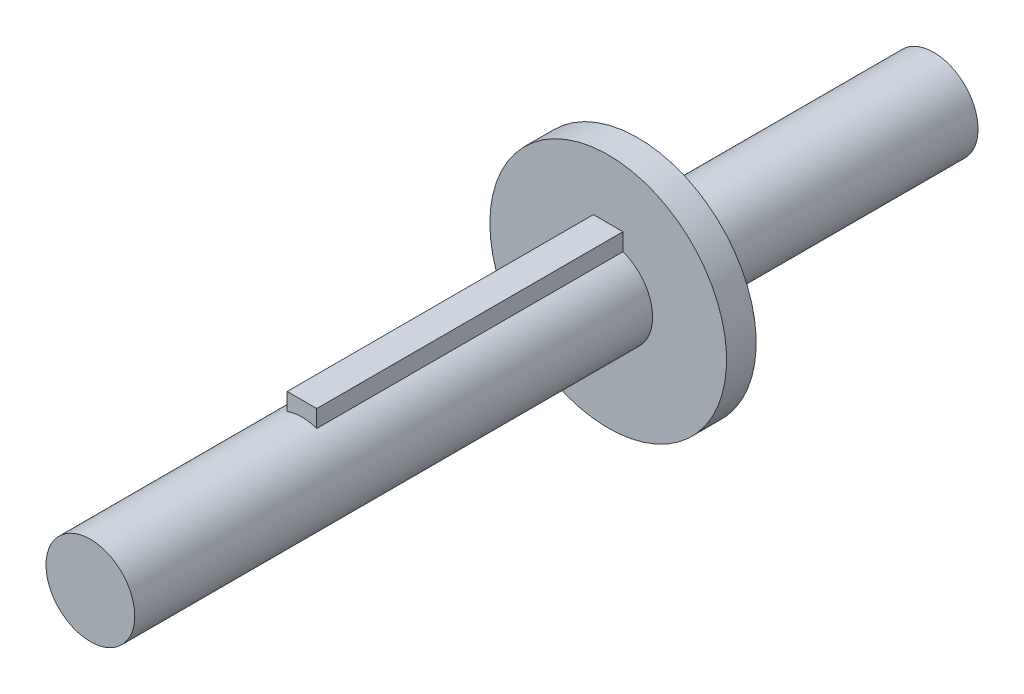
ISO-10303-21;
HEADER;
FILE_DESCRIPTION(('STEP AP214'),'2;1');
FILE_NAME('part.step','',(''),(''),'','','');
FILE_SCHEMA(('AUTOMOTIVE_DESIGN { 1 0 10303 214 1 1 1 1 }'));
ENDSEC;
DATA;
#1=APPLICATION_CONTEXT('core data for automotive mechanical design processes');
#2=APPLICATION_PROTOCOL_DEFINITION('international standard','automotive_design',2000,#1);
#3=PRODUCT_CONTEXT('',#1,'mechanical');
#4=PRODUCT('Part','Part','',(#3));
#5=PRODUCT_RELATED_PRODUCT_CATEGORY('part','',(#4));
#6=PRODUCT_DEFINITION_FORMATION('','',#4);
#7=PRODUCT_DEFINITION_CONTEXT('part definition',#1,'design');
#8=PRODUCT_DEFINITION('design','',#6,#7);
#9=PRODUCT_DEFINITION_SHAPE('','',#8);
#10=(LENGTH_UNIT() NAMED_UNIT(*) SI_UNIT(.MILLI.,.METRE.));
#11=(NAMED_UNIT(*) PLANE_ANGLE_UNIT() SI_UNIT($,.RADIAN.));
#12=(NAMED_UNIT(*) SI_UNIT($,.STERADIAN.) SOLID_ANGLE_UNIT());
#13=UNCERTAINTY_MEASURE_WITH_UNIT(LENGTH_MEASURE(1.E-05),#10,'distance_accuracy_value','');
#14=(GEOMETRIC_REPRESENTATION_CONTEXT(3) GLOBAL_UNCERTAINTY_ASSIGNED_CONTEXT((#13)) GLOBAL_UNIT_ASSIGNED_CONTEXT((#10,
#11,#12)) REPRESENTATION_CONTEXT('',''));
#15=CARTESIAN_POINT('',(0.,0.,0.));
#16=DIRECTION('',(0.,0.,1.));
#17=DIRECTION('',(1.,0.,0.));
#18=AXIS2_PLACEMENT_3D('',#15,#16,#17);
#19=CARTESIAN_POINT('',(0.,0.,35.));
#20=DIRECTION('',(0.,0.,-1.));
#21=DIRECTION('',(-1.,0.,0.));
#22=AXIS2_PLACEMENT_3D('',#19,#20,#21);
#23=CYLINDRICAL_SURFACE('',#22,3.);
#24=CARTESIAN_POINT('',(0.,0.,0.));
#25=DIRECTION('',(0.,0.,1.));
#26=DIRECTION('',(1.,0.,0.));
#27=AXIS2_PLACEMENT_3D('',#24,#25,#26);
#28=CIRCLE('',#27,3.);
#29=CARTESIAN_POINT('',(-1.,2.82842712474619,0.));
#30=VERTEX_POINT('',#29);
#31=CARTESIAN_POINT('',(1.,2.82842712474619,0.));
#32=VERTEX_POINT('',#31);
#33=EDGE_CURVE('E115',#30,#32,#28,.T.);
#34=ORIENTED_EDGE('',*,*,#33,.T.);
#35=DIRECTION('',(0.,0.,-1.));
#36=VECTOR('',#35,1.);
#37=CARTESIAN_POINT('',(1.,2.82842712474619,20.7));
#38=LINE('',#37,#36);
#39=CARTESIAN_POINT('',(1.,2.82842712474619,20.7));
#40=VERTEX_POINT('',#39);
#41=EDGE_CURVE('E77',#40,#32,#38,.T.);
#42=ORIENTED_EDGE('',*,*,#41,.F.);
#43=CARTESIAN_POINT('',(0.,0.,20.7));
#44=DIRECTION('',(0.,0.,1.));
#45=DIRECTION('',(1.,0.,0.));
#46=AXIS2_PLACEMENT_3D('',#43,#44,#45);
#47=CIRCLE('',#46,3.);
#48=CARTESIAN_POINT('',(-1.,2.82842712474619,20.7));
#49=VERTEX_POINT('',#48);
#50=EDGE_CURVE('E40',#40,#49,#47,.T.);
#51=ORIENTED_EDGE('',*,*,#50,.T.);
#52=DIRECTION('',(0.,0.,-1.));
#53=VECTOR('',#52,1.);
#54=CARTESIAN_POINT('',(-1.,2.82842712474619,20.7));
#55=LINE('',#54,#53);
#56=EDGE_CURVE('E84',#49,#30,#55,.T.);
#57=ORIENTED_EDGE('',*,*,#56,.T.);
#58=EDGE_LOOP('',(#34,#42,#51,#57));
#59=FACE_BOUND('',#58,.T.);
#60=CARTESIAN_POINT('',(0.,0.,35.));
#61=DIRECTION('',(0.,0.,1.));
#62=DIRECTION('',(1.,0.,0.));
#63=AXIS2_PLACEMENT_3D('',#60,#61,#62);
#64=CIRCLE('',#63,3.);
#65=CARTESIAN_POINT('',(3.,0.,35.));
#66=VERTEX_POINT('',#65);
#67=EDGE_CURVE('E118',#66,#66,#64,.T.);
#68=ORIENTED_EDGE('',*,*,#67,.F.);
#69=EDGE_LOOP('',(#68));
#70=FACE_BOUND('',#69,.T.);
#71=ADVANCED_FACE('F37',(#59,#70),#23,.T.);
#72=CARTESIAN_POINT('',(0.,0.,35.));
#73=DIRECTION('',(0.,0.,1.));
#74=DIRECTION('',(1.,0.,0.));
#75=AXIS2_PLACEMENT_3D('',#72,#73,#74);
#76=PLANE('',#75);
#77=ORIENTED_EDGE('',*,*,#67,.T.);
#78=EDGE_LOOP('',(#77));
#79=FACE_BOUND('',#78,.T.);
#80=ADVANCED_FACE('F139',(#79),#76,.T.);
#81=CARTESIAN_POINT('',(0.,0.,-2.));
#82=DIRECTION('',(0.,0.,1.));
#83=DIRECTION('',(1.,0.,0.));
#84=AXIS2_PLACEMENT_3D('',#81,#82,#83);
#85=CYLINDRICAL_SURFACE('',#84,8.);
#86=CARTESIAN_POINT('',(0.,0.,-2.));
#87=DIRECTION('',(0.,0.,-1.));
#88=DIRECTION('',(-1.,0.,0.));
#89=AXIS2_PLACEMENT_3D('',#86,#87,#88);
#90=CIRCLE('',#89,8.);
#91=CARTESIAN_POINT('',(-8.,0.,-2.));
#92=VERTEX_POINT('',#91);
#93=EDGE_CURVE('E112',#92,#92,#90,.T.);
#94=ORIENTED_EDGE('',*,*,#93,.F.);
#95=EDGE_LOOP('',(#94));
#96=FACE_BOUND('',#95,.T.);
#97=CARTESIAN_POINT('',(0.,0.,0.));
#98=DIRECTION('',(0.,0.,-1.));
#99=DIRECTION('',(-1.,0.,0.));
#100=AXIS2_PLACEMENT_3D('',#97,#98,#99);
#101=CIRCLE('',#100,8.);
#102=CARTESIAN_POINT('',(-8.,0.,0.));
#103=VERTEX_POINT('',#102);
#104=EDGE_CURVE('E109',#103,#103,#101,.T.);
#105=ORIENTED_EDGE('',*,*,#104,.T.);
#106=EDGE_LOOP('',(#105));
#107=FACE_BOUND('',#106,.T.);
#108=ADVANCED_FACE('F143',(#96,#107),#85,.T.);
#109=CARTESIAN_POINT('',(0.,0.,-2.));
#110=DIRECTION('',(0.,0.,-1.));
#111=DIRECTION('',(-1.,0.,0.));
#112=AXIS2_PLACEMENT_3D('',#109,#110,#111);
#113=PLANE('',#112);
#114=CARTESIAN_POINT('',(0.,0.,-2.));
#115=DIRECTION('',(0.,0.,-1.));
#116=DIRECTION('',(-1.,0.,0.));
#117=AXIS2_PLACEMENT_3D('',#114,#115,#116);
#118=CIRCLE('',#117,3.);
#119=CARTESIAN_POINT('',(-3.,0.,-2.));
#120=VERTEX_POINT('',#119);
#121=EDGE_CURVE('E11',#120,#120,#118,.T.);
#122=ORIENTED_EDGE('',*,*,#121,.F.);
#123=EDGE_LOOP('',(#122));
#124=FACE_BOUND('',#123,.T.);
#125=ORIENTED_EDGE('',*,*,#93,.T.);
#126=EDGE_LOOP('',(#125));
#127=FACE_BOUND('',#126,.T.);
#128=ADVANCED_FACE('F135',(#124,#127),#113,.T.);
#129=CARTESIAN_POINT('',(0.,0.,0.));
#130=DIRECTION('',(0.,0.,-1.));
#131=DIRECTION('',(-1.,0.,0.));
#132=AXIS2_PLACEMENT_3D('',#129,#130,#131);
#133=PLANE('',#132);
#134=DIRECTION('',(1.,0.,0.));
#135=VECTOR('',#134,1.);
#136=CARTESIAN_POINT('',(1.,3.99842712474619,0.));
#137=LINE('',#136,#135);
#138=CARTESIAN_POINT('',(-1.,3.99842712474619,0.));
#139=VERTEX_POINT('',#138);
#140=CARTESIAN_POINT('',(1.,3.99842712474619,0.));
#141=VERTEX_POINT('',#140);
#142=EDGE_CURVE('E52',#139,#141,#137,.T.);
#143=ORIENTED_EDGE('',*,*,#142,.T.);
#144=DIRECTION('',(0.,-1.,0.));
#145=VECTOR('',#144,1.);
#146=CARTESIAN_POINT('',(1.,2.82842712474619,0.));
#147=LINE('',#146,#145);
#148=EDGE_CURVE('E98',#141,#32,#147,.T.);
#149=ORIENTED_EDGE('',*,*,#148,.T.);
#150=ORIENTED_EDGE('',*,*,#33,.F.);
#151=DIRECTION('',(0.,1.,0.));
#152=VECTOR('',#151,1.);
#153=CARTESIAN_POINT('',(-1.,3.99842712474619,0.));
#154=LINE('',#153,#152);
#155=EDGE_CURVE('E104',#30,#139,#154,.T.);
#156=ORIENTED_EDGE('',*,*,#155,.T.);
#157=EDGE_LOOP('',(#143,#149,#150,#156));
#158=FACE_BOUND('',#157,.T.);
#159=ORIENTED_EDGE('',*,*,#104,.F.);
#160=EDGE_LOOP('',(#159));
#161=FACE_BOUND('',#160,.T.);
#162=ADVANCED_FACE('F125',(#158,#161),#133,.F.);
#163=CARTESIAN_POINT('',(1.,2.82842712474619,20.7));
#164=DIRECTION('',(1.,0.,0.));
#165=DIRECTION('',(0.,0.,-1.));
#166=AXIS2_PLACEMENT_3D('',#163,#164,#165);
#167=PLANE('',#166);
#168=ORIENTED_EDGE('',*,*,#148,.F.);
#169=DIRECTION('',(0.,0.,-1.));
#170=VECTOR('',#169,1.);
#171=CARTESIAN_POINT('',(1.,3.99842712474619,20.7));
#172=LINE('',#171,#170);
#173=CARTESIAN_POINT('',(1.,3.99842712474619,20.7));
#174=VERTEX_POINT('',#173);
#175=EDGE_CURVE('E91',#174,#141,#172,.T.);
#176=ORIENTED_EDGE('',*,*,#175,.F.);
#177=DIRECTION('',(0.,-1.,0.));
#178=VECTOR('',#177,1.);
#179=CARTESIAN_POINT('',(1.,2.82842712474619,20.7));
#180=LINE('',#179,#178);
#181=EDGE_CURVE('E95',#174,#40,#180,.T.);
#182=ORIENTED_EDGE('',*,*,#181,.T.);
#183=ORIENTED_EDGE('',*,*,#41,.T.);
#184=EDGE_LOOP('',(#168,#176,#182,#183));
#185=FACE_BOUND('',#184,.T.);
#186=ADVANCED_FACE('F127',(#185),#167,.T.);
#187=CARTESIAN_POINT('',(1.,3.99842712474619,20.7));
#188=DIRECTION('',(0.,1.,0.));
#189=DIRECTION('',(0.,0.,1.));
#190=AXIS2_PLACEMENT_3D('',#187,#188,#189);
#191=PLANE('',#190);
#192=ORIENTED_EDGE('',*,*,#142,.F.);
#193=DIRECTION('',(0.,0.,-1.));
#194=VECTOR('',#193,1.);
#195=CARTESIAN_POINT('',(-1.,3.99842712474619,20.7));
#196=LINE('',#195,#194);
#197=CARTESIAN_POINT('',(-1.,3.99842712474619,20.7));
#198=VERTEX_POINT('',#197);
#199=EDGE_CURVE('E86',#198,#139,#196,.T.);
#200=ORIENTED_EDGE('',*,*,#199,.F.);
#201=DIRECTION('',(1.,0.,0.));
#202=VECTOR('',#201,1.);
#203=CARTESIAN_POINT('',(1.,3.99842712474619,20.7));
#204=LINE('',#203,#202);
#205=EDGE_CURVE('E89',#198,#174,#204,.T.);
#206=ORIENTED_EDGE('',*,*,#205,.T.);
#207=ORIENTED_EDGE('',*,*,#175,.T.);
#208=EDGE_LOOP('',(#192,#200,#206,#207));
#209=FACE_BOUND('',#208,.T.);
#210=ADVANCED_FACE('F88',(#209),#191,.T.);
#211=CARTESIAN_POINT('',(-1.,3.99842712474619,20.7));
#212=DIRECTION('',(-1.,0.,0.));
#213=DIRECTION('',(0.,0.,1.));
#214=AXIS2_PLACEMENT_3D('',#211,#212,#213);
#215=PLANE('',#214);
#216=ORIENTED_EDGE('',*,*,#155,.F.);
#217=ORIENTED_EDGE('',*,*,#56,.F.);
#218=DIRECTION('',(0.,1.,0.));
#219=VECTOR('',#218,1.);
#220=CARTESIAN_POINT('',(-1.,3.99842712474619,20.7));
#221=LINE('',#220,#219);
#222=EDGE_CURVE('E94',#49,#198,#221,.T.);
#223=ORIENTED_EDGE('',*,*,#222,.T.);
#224=ORIENTED_EDGE('',*,*,#199,.T.);
#225=EDGE_LOOP('',(#216,#217,#223,#224));
#226=FACE_BOUND('',#225,.T.);
#227=ADVANCED_FACE('F97',(#226),#215,.T.);
#228=CARTESIAN_POINT('',(0.,0.,20.7));
#229=DIRECTION('',(0.,0.,1.));
#230=DIRECTION('',(1.,0.,0.));
#231=AXIS2_PLACEMENT_3D('',#228,#229,#230);
#232=PLANE('',#231);
#233=ORIENTED_EDGE('',*,*,#50,.F.);
#234=ORIENTED_EDGE('',*,*,#181,.F.);
#235=ORIENTED_EDGE('',*,*,#205,.F.);
#236=ORIENTED_EDGE('',*,*,#222,.F.);
#237=EDGE_LOOP('',(#233,#234,#235,#236));
#238=FACE_BOUND('',#237,.T.);
#239=ADVANCED_FACE('F93',(#238),#232,.T.);
#240=CARTESIAN_POINT('',(0.,0.,-22.));
#241=DIRECTION('',(0.,0.,1.));
#242=DIRECTION('',(1.,0.,0.));
#243=AXIS2_PLACEMENT_3D('',#240,#241,#242);
#244=CYLINDRICAL_SURFACE('',#243,3.);
#245=CARTESIAN_POINT('',(0.,0.,-22.));
#246=DIRECTION('',(0.,0.,-1.));
#247=DIRECTION('',(-1.,0.,0.));
#248=AXIS2_PLACEMENT_3D('',#245,#246,#247);
#249=CIRCLE('',#248,3.);
#250=CARTESIAN_POINT('',(-3.,0.,-22.));
#251=VERTEX_POINT('',#250);
#252=EDGE_CURVE('E106',#251,#251,#249,.T.);
#253=ORIENTED_EDGE('',*,*,#252,.F.);
#254=EDGE_LOOP('',(#253));
#255=FACE_BOUND('',#254,.T.);
#256=ORIENTED_EDGE('',*,*,#121,.T.);
#257=EDGE_LOOP('',(#256));
#258=FACE_BOUND('',#257,.T.);
#259=ADVANCED_FACE('F158',(#255,#258),#244,.T.);
#260=CARTESIAN_POINT('',(0.,0.,-22.));
#261=DIRECTION('',(0.,0.,-1.));
#262=DIRECTION('',(-1.,0.,0.));
#263=AXIS2_PLACEMENT_3D('',#260,#261,#262);
#264=PLANE('',#263);
#265=ORIENTED_EDGE('',*,*,#252,.T.);
#266=EDGE_LOOP('',(#265));
#267=FACE_BOUND('',#266,.T.);
#268=ADVANCED_FACE('F162',(#267),#264,.T.);
#269=CLOSED_SHELL('',(#71,#80,#108,#128,#162,#186,#210,#227,#239,#259,#268));
#270=MANIFOLD_SOLID_BREP('B2',#269);
#271=ADVANCED_BREP_SHAPE_REPRESENTATION('',(#18,#270),#14);
#272=SHAPE_DEFINITION_REPRESENTATION(#9,#271);
ENDSEC;
END-ISO-10303-21;
